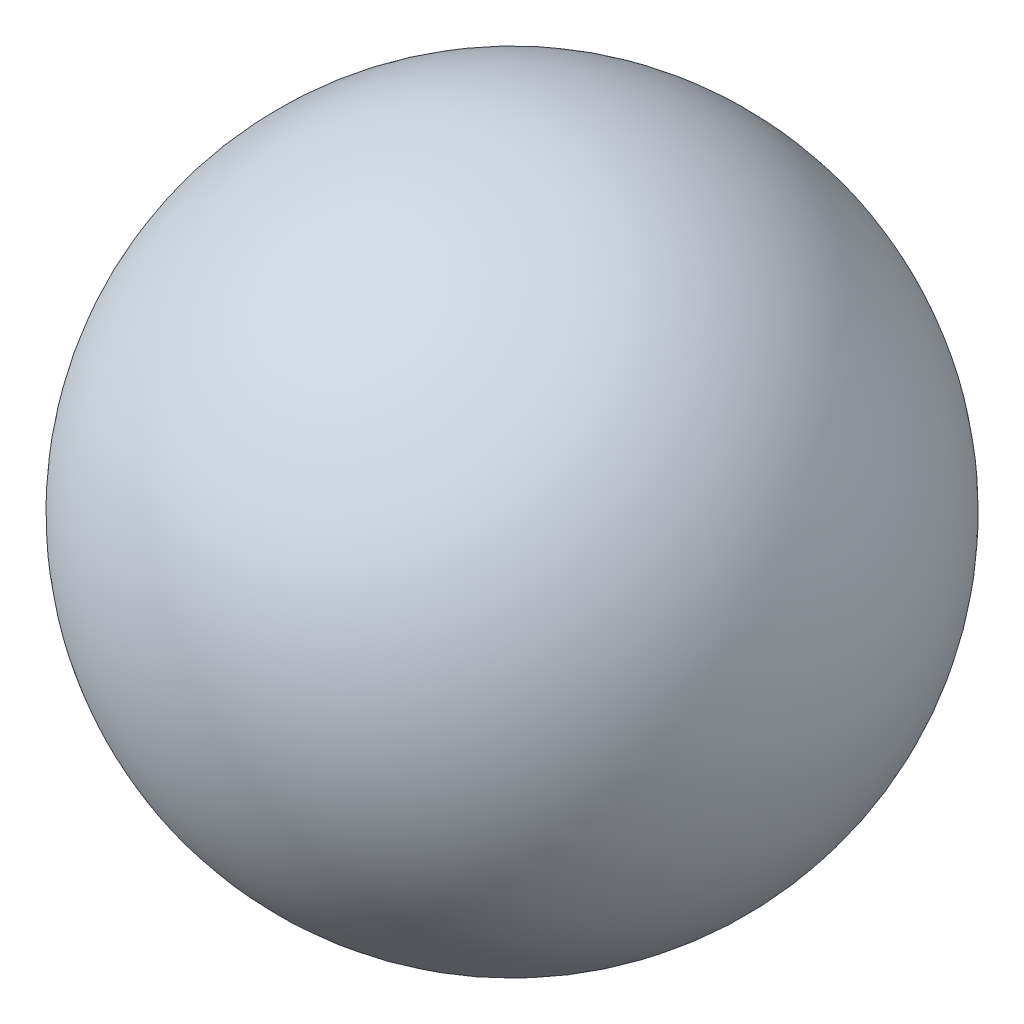
ISO-10303-21;
HEADER;
FILE_DESCRIPTION(('STEP AP214'),'2;1');
FILE_NAME('part.step','',(''),(''),'','','');
FILE_SCHEMA(('AUTOMOTIVE_DESIGN { 1 0 10303 214 1 1 1 1 }'));
ENDSEC;
DATA;
#1=APPLICATION_CONTEXT('core data for automotive mechanical design processes');
#2=APPLICATION_PROTOCOL_DEFINITION('international standard','automotive_design',2000,#1);
#3=PRODUCT_CONTEXT('',#1,'mechanical');
#4=PRODUCT('Part','Part','',(#3));
#5=PRODUCT_RELATED_PRODUCT_CATEGORY('part','',(#4));
#6=PRODUCT_DEFINITION_FORMATION('','',#4);
#7=PRODUCT_DEFINITION_CONTEXT('part definition',#1,'design');
#8=PRODUCT_DEFINITION('design','',#6,#7);
#9=PRODUCT_DEFINITION_SHAPE('','',#8);
#10=(LENGTH_UNIT() NAMED_UNIT(*) SI_UNIT(.MILLI.,.METRE.));
#11=(NAMED_UNIT(*) PLANE_ANGLE_UNIT() SI_UNIT($,.RADIAN.));
#12=(NAMED_UNIT(*) SI_UNIT($,.STERADIAN.) SOLID_ANGLE_UNIT());
#13=UNCERTAINTY_MEASURE_WITH_UNIT(LENGTH_MEASURE(1.E-05),#10,'distance_accuracy_value','');
#14=(GEOMETRIC_REPRESENTATION_CONTEXT(3) GLOBAL_UNCERTAINTY_ASSIGNED_CONTEXT((#13)) GLOBAL_UNIT_ASSIGNED_CONTEXT((#10,
#11,#12)) REPRESENTATION_CONTEXT('',''));
#15=CARTESIAN_POINT('',(0.,0.,0.));
#16=DIRECTION('',(0.,0.,1.));
#17=DIRECTION('',(1.,0.,0.));
#18=AXIS2_PLACEMENT_3D('',#15,#16,#17);
#19=CARTESIAN_POINT('',(0.,0.,0.));
#20=DIRECTION('',(0.,0.,1.));
#21=DIRECTION('',(-1.,0.,0.));
#22=AXIS2_PLACEMENT_3D('',#19,#20,#21);
#23=SPHERICAL_SURFACE('',#22,4.);
#24=CARTESIAN_POINT('',(0.,0.,4.));
#25=VERTEX_POINT('',#24);
#26=VERTEX_LOOP('',#25);
#27=FACE_BOUND('',#26,.T.);
#28=ADVANCED_FACE('F31',(#27),#23,.T.);
#29=CLOSED_SHELL('',(#28));
#30=MANIFOLD_SOLID_BREP('B2',#29);
#31=ADVANCED_BREP_SHAPE_REPRESENTATION('',(#18,#30),#14);
#32=SHAPE_DEFINITION_REPRESENTATION(#9,#31);
ENDSEC;
END-ISO-10303-21;
